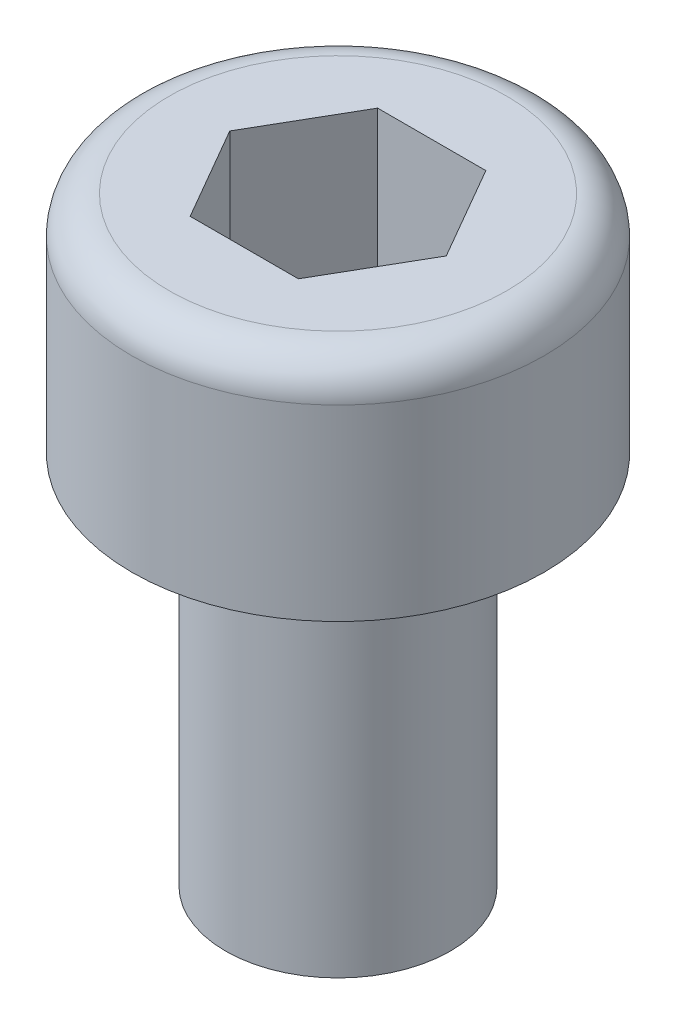
ISO-10303-21;
HEADER;
FILE_DESCRIPTION(('STEP AP214'),'2;1');
FILE_NAME('part.step','',(''),(''),'','','');
FILE_SCHEMA(('AUTOMOTIVE_DESIGN { 1 0 10303 214 1 1 1 1 }'));
ENDSEC;
DATA;
#1=APPLICATION_CONTEXT('core data for automotive mechanical design processes');
#2=APPLICATION_PROTOCOL_DEFINITION('international standard','automotive_design',2000,#1);
#3=PRODUCT_CONTEXT('',#1,'mechanical');
#4=PRODUCT('Part','Part','',(#3));
#5=PRODUCT_RELATED_PRODUCT_CATEGORY('part','',(#4));
#6=PRODUCT_DEFINITION_FORMATION('','',#4);
#7=PRODUCT_DEFINITION_CONTEXT('part definition',#1,'design');
#8=PRODUCT_DEFINITION('design','',#6,#7);
#9=PRODUCT_DEFINITION_SHAPE('','',#8);
#10=(LENGTH_UNIT() NAMED_UNIT(*) SI_UNIT(.MILLI.,.METRE.));
#11=(NAMED_UNIT(*) PLANE_ANGLE_UNIT() SI_UNIT($,.RADIAN.));
#12=(NAMED_UNIT(*) SI_UNIT($,.STERADIAN.) SOLID_ANGLE_UNIT());
#13=UNCERTAINTY_MEASURE_WITH_UNIT(LENGTH_MEASURE(1.E-05),#10,'distance_accuracy_value','');
#14=(GEOMETRIC_REPRESENTATION_CONTEXT(3) GLOBAL_UNCERTAINTY_ASSIGNED_CONTEXT((#13)) GLOBAL_UNIT_ASSIGNED_CONTEXT((#10,
#11,#12)) REPRESENTATION_CONTEXT('',''));
#15=CARTESIAN_POINT('',(0.,0.,0.));
#16=DIRECTION('',(0.,0.,1.));
#17=DIRECTION('',(1.,0.,0.));
#18=AXIS2_PLACEMENT_3D('',#15,#16,#17);
#19=CARTESIAN_POINT('',(0.,2.5,0.));
#20=DIRECTION('',(0.,-1.,0.));
#21=DIRECTION('',(1.,0.,0.));
#22=AXIS2_PLACEMENT_3D('',#19,#20,#21);
#23=TOROIDAL_SURFACE('',#22,2.25,0.5);
#24=CARTESIAN_POINT('',(0.,3.,0.));
#25=DIRECTION('',(0.,-1.,0.));
#26=DIRECTION('',(1.,0.,0.));
#27=AXIS2_PLACEMENT_3D('',#24,#25,#26);
#28=CIRCLE('',#27,2.25);
#29=CARTESIAN_POINT('',(2.25,3.,0.));
#30=VERTEX_POINT('',#29);
#31=EDGE_CURVE('E133',#30,#30,#28,.T.);
#32=ORIENTED_EDGE('',*,*,#31,.T.);
#33=EDGE_LOOP('',(#32));
#34=FACE_BOUND('',#33,.T.);
#35=CARTESIAN_POINT('',(0.,2.5,0.));
#36=DIRECTION('',(0.,-1.,0.));
#37=DIRECTION('',(1.,0.,0.));
#38=AXIS2_PLACEMENT_3D('',#35,#36,#37);
#39=CIRCLE('',#38,2.75);
#40=CARTESIAN_POINT('',(2.75,2.5,0.));
#41=VERTEX_POINT('',#40);
#42=EDGE_CURVE('E11',#41,#41,#39,.T.);
#43=ORIENTED_EDGE('',*,*,#42,.F.);
#44=EDGE_LOOP('',(#43));
#45=FACE_BOUND('',#44,.T.);
#46=ADVANCED_FACE('F30',(#34,#45),#23,.T.);
#47=CARTESIAN_POINT('',(0.,3.,0.));
#48=DIRECTION('',(0.,-1.,0.));
#49=DIRECTION('',(1.,0.,0.));
#50=AXIS2_PLACEMENT_3D('',#47,#48,#49);
#51=CYLINDRICAL_SURFACE('',#50,2.75);
#52=ORIENTED_EDGE('',*,*,#42,.T.);
#53=EDGE_LOOP('',(#52));
#54=FACE_BOUND('',#53,.T.);
#55=CARTESIAN_POINT('',(0.,0.,0.));
#56=DIRECTION('',(0.,-1.,0.));
#57=DIRECTION('',(1.,0.,0.));
#58=AXIS2_PLACEMENT_3D('',#55,#56,#57);
#59=CIRCLE('',#58,2.75);
#60=CARTESIAN_POINT('',(2.75,0.,0.));
#61=VERTEX_POINT('',#60);
#62=EDGE_CURVE('E37',#61,#61,#59,.T.);
#63=ORIENTED_EDGE('',*,*,#62,.F.);
#64=EDGE_LOOP('',(#63));
#65=FACE_BOUND('',#64,.T.);
#66=ADVANCED_FACE('F153',(#54,#65),#51,.T.);
#67=CARTESIAN_POINT('',(2.75,0.,0.));
#68=DIRECTION('',(0.,-1.,0.));
#69=DIRECTION('',(1.,0.,0.));
#70=AXIS2_PLACEMENT_3D('',#67,#68,#69);
#71=PLANE('',#70);
#72=ORIENTED_EDGE('',*,*,#62,.T.);
#73=EDGE_LOOP('',(#72));
#74=FACE_BOUND('',#73,.T.);
#75=CARTESIAN_POINT('',(0.,0.,0.));
#76=DIRECTION('',(0.,-1.,0.));
#77=DIRECTION('',(1.,0.,0.));
#78=AXIS2_PLACEMENT_3D('',#75,#76,#77);
#79=CIRCLE('',#78,1.5);
#80=CARTESIAN_POINT('',(1.5,0.,0.));
#81=VERTEX_POINT('',#80);
#82=EDGE_CURVE('E145',#81,#81,#79,.T.);
#83=ORIENTED_EDGE('',*,*,#82,.F.);
#84=EDGE_LOOP('',(#83));
#85=FACE_BOUND('',#84,.T.);
#86=ADVANCED_FACE('F150',(#74,#85),#71,.T.);
#87=CARTESIAN_POINT('',(0.,3.,0.));
#88=DIRECTION('',(0.,-1.,0.));
#89=DIRECTION('',(1.,0.,0.));
#90=AXIS2_PLACEMENT_3D('',#87,#88,#89);
#91=CYLINDRICAL_SURFACE('',#90,1.5);
#92=ORIENTED_EDGE('',*,*,#82,.T.);
#93=EDGE_LOOP('',(#92));
#94=FACE_BOUND('',#93,.T.);
#95=CARTESIAN_POINT('',(0.,-5.,0.));
#96=DIRECTION('',(0.,-1.,0.));
#97=DIRECTION('',(1.,0.,0.));
#98=AXIS2_PLACEMENT_3D('',#95,#96,#97);
#99=CIRCLE('',#98,1.5);
#100=CARTESIAN_POINT('',(1.5,-5.,0.));
#101=VERTEX_POINT('',#100);
#102=EDGE_CURVE('E142',#101,#101,#99,.T.);
#103=ORIENTED_EDGE('',*,*,#102,.F.);
#104=EDGE_LOOP('',(#103));
#105=FACE_BOUND('',#104,.T.);
#106=ADVANCED_FACE('F160',(#94,#105),#91,.T.);
#107=CARTESIAN_POINT('',(0.,-5.40192378864669,0.));
#108=DIRECTION('',(0.,1.,0.));
#109=DIRECTION('',(-1.,0.,0.));
#110=AXIS2_PLACEMENT_3D('',#107,#108,#109);
#111=CONICAL_SURFACE('',#110,0.,1.30899693899574);
#112=ORIENTED_EDGE('',*,*,#102,.T.);
#113=EDGE_LOOP('',(#112));
#114=FACE_BOUND('',#113,.T.);
#115=CARTESIAN_POINT('',(0.,-5.40192378864669,0.));
#116=VERTEX_POINT('',#115);
#117=VERTEX_LOOP('',#116);
#118=FACE_BOUND('',#117,.T.);
#119=ADVANCED_FACE('F166',(#114,#118),#111,.T.);
#120=CARTESIAN_POINT('',(0.,3.,0.));
#121=DIRECTION('',(0.,1.,0.));
#122=DIRECTION('',(-1.,0.,0.));
#123=AXIS2_PLACEMENT_3D('',#120,#121,#122);
#124=PLANE('',#123);
#125=DIRECTION('',(0.5,0.,-0.866025403784439));
#126=VECTOR('',#125,1.);
#127=CARTESIAN_POINT('',(0.721687836487033,3.,1.25));
#128=LINE('',#127,#126);
#129=CARTESIAN_POINT('',(0.721687836487033,3.,1.25));
#130=VERTEX_POINT('',#129);
#131=CARTESIAN_POINT('',(1.44337567297406,3.,0.));
#132=VERTEX_POINT('',#131);
#133=EDGE_CURVE('E44',#130,#132,#128,.T.);
#134=ORIENTED_EDGE('',*,*,#133,.F.);
#135=DIRECTION('',(1.,0.,0.));
#136=VECTOR('',#135,1.);
#137=CARTESIAN_POINT('',(-0.721687836487032,3.,1.25));
#138=LINE('',#137,#136);
#139=CARTESIAN_POINT('',(-0.721687836487032,3.,1.25));
#140=VERTEX_POINT('',#139);
#141=EDGE_CURVE('E113',#140,#130,#138,.T.);
#142=ORIENTED_EDGE('',*,*,#141,.F.);
#143=DIRECTION('',(0.5,0.,0.866025403784439));
#144=VECTOR('',#143,1.);
#145=CARTESIAN_POINT('',(-1.44337567297406,3.,0.));
#146=LINE('',#145,#144);
#147=CARTESIAN_POINT('',(-1.44337567297406,3.,0.));
#148=VERTEX_POINT('',#147);
#149=EDGE_CURVE('E107',#148,#140,#146,.T.);
#150=ORIENTED_EDGE('',*,*,#149,.F.);
#151=DIRECTION('',(-0.5,0.,0.866025403784439));
#152=VECTOR('',#151,1.);
#153=CARTESIAN_POINT('',(-0.721687836487032,3.,-1.25));
#154=LINE('',#153,#152);
#155=CARTESIAN_POINT('',(-0.721687836487032,3.,-1.25));
#156=VERTEX_POINT('',#155);
#157=EDGE_CURVE('E105',#156,#148,#154,.T.);
#158=ORIENTED_EDGE('',*,*,#157,.F.);
#159=DIRECTION('',(-1.,0.,0.));
#160=VECTOR('',#159,1.);
#161=CARTESIAN_POINT('',(0.721687836487032,3.,-1.25));
#162=LINE('',#161,#160);
#163=CARTESIAN_POINT('',(0.721687836487032,3.,-1.25));
#164=VERTEX_POINT('',#163);
#165=EDGE_CURVE('E86',#164,#156,#162,.T.);
#166=ORIENTED_EDGE('',*,*,#165,.F.);
#167=DIRECTION('',(-0.5,0.,-0.866025403784439));
#168=VECTOR('',#167,1.);
#169=CARTESIAN_POINT('',(1.44337567297406,3.,0.));
#170=LINE('',#169,#168);
#171=EDGE_CURVE('E97',#132,#164,#170,.T.);
#172=ORIENTED_EDGE('',*,*,#171,.F.);
#173=EDGE_LOOP('',(#134,#142,#150,#158,#166,#172));
#174=FACE_BOUND('',#173,.T.);
#175=ORIENTED_EDGE('',*,*,#31,.F.);
#176=EDGE_LOOP('',(#175));
#177=FACE_BOUND('',#176,.T.);
#178=ADVANCED_FACE('F101',(#174,#177),#124,.T.);
#179=CARTESIAN_POINT('',(0.721687836487033,1.,1.25));
#180=DIRECTION('',(0.866025403784439,0.,0.5));
#181=DIRECTION('',(0.5,0.,-0.866025403784439));
#182=AXIS2_PLACEMENT_3D('',#179,#180,#181);
#183=PLANE('',#182);
#184=ORIENTED_EDGE('',*,*,#133,.T.);
#185=DIRECTION('',(0.,1.,0.));
#186=VECTOR('',#185,1.);
#187=CARTESIAN_POINT('',(1.44337567297406,1.,0.));
#188=LINE('',#187,#186);
#189=CARTESIAN_POINT('',(1.44337567297406,1.,0.));
#190=VERTEX_POINT('',#189);
#191=EDGE_CURVE('E94',#190,#132,#188,.T.);
#192=ORIENTED_EDGE('',*,*,#191,.F.);
#193=DIRECTION('',(0.5,0.,-0.866025403784439));
#194=VECTOR('',#193,1.);
#195=CARTESIAN_POINT('',(0.721687836487033,1.,1.25));
#196=LINE('',#195,#194);
#197=CARTESIAN_POINT('',(0.721687836487033,1.,1.25));
#198=VERTEX_POINT('',#197);
#199=EDGE_CURVE('E116',#198,#190,#196,.T.);
#200=ORIENTED_EDGE('',*,*,#199,.F.);
#201=DIRECTION('',(0.,1.,0.));
#202=VECTOR('',#201,1.);
#203=CARTESIAN_POINT('',(0.721687836487033,1.,1.25));
#204=LINE('',#203,#202);
#205=EDGE_CURVE('E131',#198,#130,#204,.T.);
#206=ORIENTED_EDGE('',*,*,#205,.T.);
#207=EDGE_LOOP('',(#184,#192,#200,#206));
#208=FACE_BOUND('',#207,.T.);
#209=ADVANCED_FACE('F173',(#208),#183,.F.);
#210=CARTESIAN_POINT('',(-0.721687836487032,1.,1.25));
#211=DIRECTION('',(0.,0.,1.));
#212=DIRECTION('',(1.,0.,0.));
#213=AXIS2_PLACEMENT_3D('',#210,#211,#212);
#214=PLANE('',#213);
#215=ORIENTED_EDGE('',*,*,#141,.T.);
#216=ORIENTED_EDGE('',*,*,#205,.F.);
#217=DIRECTION('',(1.,0.,0.));
#218=VECTOR('',#217,1.);
#219=CARTESIAN_POINT('',(-0.721687836487032,1.,1.25));
#220=LINE('',#219,#218);
#221=CARTESIAN_POINT('',(-0.721687836487032,1.,1.25));
#222=VERTEX_POINT('',#221);
#223=EDGE_CURVE('E128',#222,#198,#220,.T.);
#224=ORIENTED_EDGE('',*,*,#223,.F.);
#225=DIRECTION('',(0.,1.,0.));
#226=VECTOR('',#225,1.);
#227=CARTESIAN_POINT('',(-0.721687836487032,1.,1.25));
#228=LINE('',#227,#226);
#229=EDGE_CURVE('E134',#222,#140,#228,.T.);
#230=ORIENTED_EDGE('',*,*,#229,.T.);
#231=EDGE_LOOP('',(#215,#216,#224,#230));
#232=FACE_BOUND('',#231,.T.);
#233=ADVANCED_FACE('F176',(#232),#214,.F.);
#234=CARTESIAN_POINT('',(-1.44337567297406,1.,0.));
#235=DIRECTION('',(-0.866025403784439,0.,0.5));
#236=DIRECTION('',(0.5,0.,0.866025403784439));
#237=AXIS2_PLACEMENT_3D('',#234,#235,#236);
#238=PLANE('',#237);
#239=ORIENTED_EDGE('',*,*,#149,.T.);
#240=ORIENTED_EDGE('',*,*,#229,.F.);
#241=DIRECTION('',(0.5,0.,0.866025403784439));
#242=VECTOR('',#241,1.);
#243=CARTESIAN_POINT('',(-1.44337567297406,1.,0.));
#244=LINE('',#243,#242);
#245=CARTESIAN_POINT('',(-1.44337567297406,1.,0.));
#246=VERTEX_POINT('',#245);
#247=EDGE_CURVE('E125',#246,#222,#244,.T.);
#248=ORIENTED_EDGE('',*,*,#247,.F.);
#249=DIRECTION('',(0.,1.,0.));
#250=VECTOR('',#249,1.);
#251=CARTESIAN_POINT('',(-1.44337567297406,1.,0.));
#252=LINE('',#251,#250);
#253=EDGE_CURVE('E136',#246,#148,#252,.T.);
#254=ORIENTED_EDGE('',*,*,#253,.T.);
#255=EDGE_LOOP('',(#239,#240,#248,#254));
#256=FACE_BOUND('',#255,.T.);
#257=ADVANCED_FACE('F185',(#256),#238,.F.);
#258=CARTESIAN_POINT('',(-0.721687836487032,1.,-1.25));
#259=DIRECTION('',(-0.866025403784439,0.,-0.5));
#260=DIRECTION('',(-0.5,0.,0.866025403784439));
#261=AXIS2_PLACEMENT_3D('',#258,#259,#260);
#262=PLANE('',#261);
#263=ORIENTED_EDGE('',*,*,#157,.T.);
#264=ORIENTED_EDGE('',*,*,#253,.F.);
#265=DIRECTION('',(-0.5,0.,0.866025403784439));
#266=VECTOR('',#265,1.);
#267=CARTESIAN_POINT('',(-0.721687836487032,1.,-1.25));
#268=LINE('',#267,#266);
#269=CARTESIAN_POINT('',(-0.721687836487032,1.,-1.25));
#270=VERTEX_POINT('',#269);
#271=EDGE_CURVE('E122',#270,#246,#268,.T.);
#272=ORIENTED_EDGE('',*,*,#271,.F.);
#273=DIRECTION('',(0.,1.,0.));
#274=VECTOR('',#273,1.);
#275=CARTESIAN_POINT('',(-0.721687836487032,1.,-1.25));
#276=LINE('',#275,#274);
#277=EDGE_CURVE('E93',#270,#156,#276,.T.);
#278=ORIENTED_EDGE('',*,*,#277,.T.);
#279=EDGE_LOOP('',(#263,#264,#272,#278));
#280=FACE_BOUND('',#279,.T.);
#281=ADVANCED_FACE('F182',(#280),#262,.F.);
#282=CARTESIAN_POINT('',(0.721687836487032,1.,-1.25));
#283=DIRECTION('',(0.,0.,-1.));
#284=DIRECTION('',(-1.,0.,0.));
#285=AXIS2_PLACEMENT_3D('',#282,#283,#284);
#286=PLANE('',#285);
#287=ORIENTED_EDGE('',*,*,#165,.T.);
#288=ORIENTED_EDGE('',*,*,#277,.F.);
#289=DIRECTION('',(-1.,0.,0.));
#290=VECTOR('',#289,1.);
#291=CARTESIAN_POINT('',(0.721687836487032,1.,-1.25));
#292=LINE('',#291,#290);
#293=CARTESIAN_POINT('',(0.721687836487032,1.,-1.25));
#294=VERTEX_POINT('',#293);
#295=EDGE_CURVE('E89',#294,#270,#292,.T.);
#296=ORIENTED_EDGE('',*,*,#295,.F.);
#297=DIRECTION('',(0.,1.,0.));
#298=VECTOR('',#297,1.);
#299=CARTESIAN_POINT('',(0.721687836487032,1.,-1.25));
#300=LINE('',#299,#298);
#301=EDGE_CURVE('E82',#294,#164,#300,.T.);
#302=ORIENTED_EDGE('',*,*,#301,.T.);
#303=EDGE_LOOP('',(#287,#288,#296,#302));
#304=FACE_BOUND('',#303,.T.);
#305=ADVANCED_FACE('F84',(#304),#286,.F.);
#306=CARTESIAN_POINT('',(1.44337567297406,1.,0.));
#307=DIRECTION('',(0.866025403784439,0.,-0.5));
#308=DIRECTION('',(-0.5,0.,-0.866025403784439));
#309=AXIS2_PLACEMENT_3D('',#306,#307,#308);
#310=PLANE('',#309);
#311=ORIENTED_EDGE('',*,*,#171,.T.);
#312=ORIENTED_EDGE('',*,*,#301,.F.);
#313=DIRECTION('',(-0.5,0.,-0.866025403784439));
#314=VECTOR('',#313,1.);
#315=CARTESIAN_POINT('',(1.44337567297406,1.,0.));
#316=LINE('',#315,#314);
#317=EDGE_CURVE('E119',#190,#294,#316,.T.);
#318=ORIENTED_EDGE('',*,*,#317,.F.);
#319=ORIENTED_EDGE('',*,*,#191,.T.);
#320=EDGE_LOOP('',(#311,#312,#318,#319));
#321=FACE_BOUND('',#320,.T.);
#322=ADVANCED_FACE('F98',(#321),#310,.F.);
#323=CARTESIAN_POINT('',(0.721687836487033,1.,1.25));
#324=DIRECTION('',(0.,-1.,0.));
#325=DIRECTION('',(0.,0.,-1.));
#326=AXIS2_PLACEMENT_3D('',#323,#324,#325);
#327=PLANE('',#326);
#328=ORIENTED_EDGE('',*,*,#199,.T.);
#329=ORIENTED_EDGE('',*,*,#317,.T.);
#330=ORIENTED_EDGE('',*,*,#295,.T.);
#331=ORIENTED_EDGE('',*,*,#271,.T.);
#332=ORIENTED_EDGE('',*,*,#247,.T.);
#333=ORIENTED_EDGE('',*,*,#223,.T.);
#334=EDGE_LOOP('',(#328,#329,#330,#331,#332,#333));
#335=FACE_BOUND('',#334,.T.);
#336=ADVANCED_FACE('F179',(#335),#327,.F.);
#337=CLOSED_SHELL('',(#46,#66,#86,#106,#119,#178,#209,#233,#257,#281,#305,#322,#336));
#338=MANIFOLD_SOLID_BREP('B2',#337);
#339=ADVANCED_BREP_SHAPE_REPRESENTATION('',(#18,#338),#14);
#340=SHAPE_DEFINITION_REPRESENTATION(#9,#339);
ENDSEC;
END-ISO-10303-21;
